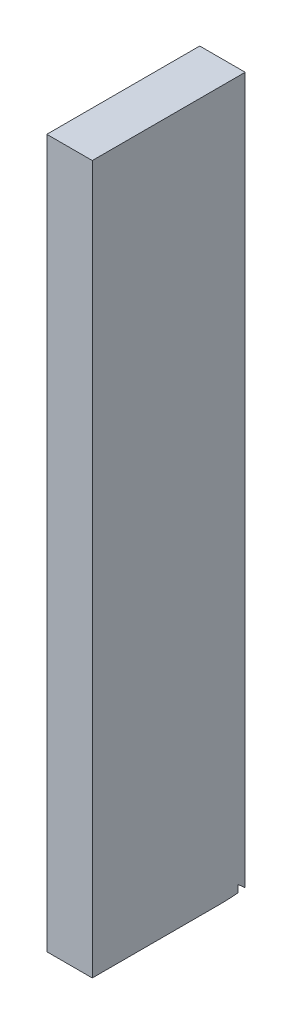
ISO-10303-21;
HEADER;
FILE_DESCRIPTION(('STEP AP214'),'2;1');
FILE_NAME('part.step','',(''),(''),'','','');
FILE_SCHEMA(('AUTOMOTIVE_DESIGN { 1 0 10303 214 1 1 1 1 }'));
ENDSEC;
DATA;
#1=APPLICATION_CONTEXT('core data for automotive mechanical design processes');
#2=APPLICATION_PROTOCOL_DEFINITION('international standard','automotive_design',2000,#1);
#3=PRODUCT_CONTEXT('',#1,'mechanical');
#4=PRODUCT('Part','Part','',(#3));
#5=PRODUCT_RELATED_PRODUCT_CATEGORY('part','',(#4));
#6=PRODUCT_DEFINITION_FORMATION('','',#4);
#7=PRODUCT_DEFINITION_CONTEXT('part definition',#1,'design');
#8=PRODUCT_DEFINITION('design','',#6,#7);
#9=PRODUCT_DEFINITION_SHAPE('','',#8);
#10=(LENGTH_UNIT() NAMED_UNIT(*) SI_UNIT(.MILLI.,.METRE.));
#11=(NAMED_UNIT(*) PLANE_ANGLE_UNIT() SI_UNIT($,.RADIAN.));
#12=(NAMED_UNIT(*) SI_UNIT($,.STERADIAN.) SOLID_ANGLE_UNIT());
#13=UNCERTAINTY_MEASURE_WITH_UNIT(LENGTH_MEASURE(1.E-05),#10,'distance_accuracy_value','');
#14=(GEOMETRIC_REPRESENTATION_CONTEXT(3) GLOBAL_UNCERTAINTY_ASSIGNED_CONTEXT((#13)) GLOBAL_UNIT_ASSIGNED_CONTEXT((#10,
#11,#12)) REPRESENTATION_CONTEXT('',''));
#15=CARTESIAN_POINT('',(0.,0.,0.));
#16=DIRECTION('',(0.,0.,1.));
#17=DIRECTION('',(1.,0.,0.));
#18=AXIS2_PLACEMENT_3D('',#15,#16,#17);
#19=CARTESIAN_POINT('',(130.275545277051,17.2651002409467,47.9190576174726));
#20=DIRECTION('',(1.69244514382854E-09,0.,-1.));
#21=DIRECTION('',(-1.,0.,-1.69244514382854E-09));
#22=AXIS2_PLACEMENT_3D('',#19,#20,#21);
#23=PLANE('',#22);
#24=CARTESIAN_POINT('',(131.258630374064,7.13214480310853,47.9190576191364));
#25=DIRECTION('',(0.,1.,0.));
#26=VECTOR('',#25,1.);
#27=LINE('',#24,#26);
#28=CARTESIAN_POINT('',(131.258630374064,7.13214480310853,47.9190576191364));
#29=VERTEX_POINT('',#28);
#30=CARTESIAN_POINT('',(131.258630374064,7.28593308702725,47.9190576191364));
#31=VERTEX_POINT('',#30);
#32=EDGE_CURVE('E119',#29,#31,#27,.T.);
#33=ORIENTED_EDGE('',*,*,#32,.F.);
#34=CARTESIAN_POINT('',(130.275545277051,7.13214480310853,47.9190576174726));
#35=DIRECTION('',(1.,0.,1.69244241849266E-09));
#36=VECTOR('',#35,1.);
#37=LINE('',#34,#36);
#38=CARTESIAN_POINT('',(130.275545277051,7.13214480310853,47.9190576174726));
#39=VERTEX_POINT('',#38);
#40=EDGE_CURVE('E35',#39,#29,#37,.T.);
#41=ORIENTED_EDGE('',*,*,#40,.F.);
#42=CARTESIAN_POINT('',(130.275545277051,7.13214480310853,47.9190576174726));
#43=DIRECTION('',(0.,1.,0.));
#44=VECTOR('',#43,1.);
#45=LINE('',#42,#44);
#46=CARTESIAN_POINT('',(130.275545277051,7.28593308702725,47.9190576174726));
#47=VERTEX_POINT('',#46);
#48=EDGE_CURVE('E237',#39,#47,#45,.T.);
#49=ORIENTED_EDGE('',*,*,#48,.T.);
#50=CARTESIAN_POINT('',(130.275545277051,7.28593308702725,47.9190576174726));
#51=DIRECTION('',(1.,0.,1.69244241849266E-09));
#52=VECTOR('',#51,1.);
#53=LINE('',#50,#52);
#54=EDGE_CURVE('E10',#47,#31,#53,.T.);
#55=ORIENTED_EDGE('',*,*,#54,.T.);
#56=EDGE_LOOP('',(#33,#41,#49,#55));
#57=FACE_BOUND('',#56,.T.);
#58=ADVANCED_FACE('F16',(#57),#23,.T.);
#59=CARTESIAN_POINT('',(130.275545277051,7.28593308702725,47.9190576174726));
#60=DIRECTION('',(-1.13344270641782E-09,-0.742625248657873,0.669707204721461));
#61=DIRECTION('',(0.,-0.669707204721461,-0.742625248657873));
#62=AXIS2_PLACEMENT_3D('',#59,#60,#61);
#63=PLANE('',#62);
#64=DIRECTION('',(1.25689951309274E-09,-0.669707204721461,-0.742625248657873));
#65=VECTOR('',#64,1.);
#66=CARTESIAN_POINT('',(131.258630374064,7.28593308702725,47.9190576191364));
#67=LINE('',#66,#65);
#68=CARTESIAN_POINT('',(131.258630374323,7.14798261558395,47.7660870337286));
#69=VERTEX_POINT('',#68);
#70=EDGE_CURVE('E144',#31,#69,#67,.T.);
#71=ORIENTED_EDGE('',*,*,#70,.F.);
#72=ORIENTED_EDGE('',*,*,#54,.F.);
#73=DIRECTION('',(1.25689951309274E-09,-0.669707204721461,-0.742625248657873));
#74=VECTOR('',#73,1.);
#75=CARTESIAN_POINT('',(130.275545277051,7.28593308702725,47.9190576174726));
#76=LINE('',#75,#74);
#77=CARTESIAN_POINT('',(130.27554527731,7.14798261558395,47.7660870320648));
#78=VERTEX_POINT('',#77);
#79=EDGE_CURVE('E315',#47,#78,#76,.T.);
#80=ORIENTED_EDGE('',*,*,#79,.T.);
#81=DIRECTION('',(1.,0.,1.69244514382854E-09));
#82=VECTOR('',#81,1.);
#83=CARTESIAN_POINT('',(130.27554527731,7.14798261558395,47.7660870320648));
#84=LINE('',#83,#82);
#85=EDGE_CURVE('E27',#78,#69,#84,.T.);
#86=ORIENTED_EDGE('',*,*,#85,.T.);
#87=EDGE_LOOP('',(#71,#72,#80,#86));
#88=FACE_BOUND('',#87,.T.);
#89=ADVANCED_FACE('F213',(#88),#63,.T.);
#90=CARTESIAN_POINT('',(130.27554527731,7.14798261558395,47.7660870320648));
#91=DIRECTION('',(1.69244514382854E-09,0.,-1.));
#92=DIRECTION('',(-1.,0.,-1.69244514382854E-09));
#93=AXIS2_PLACEMENT_3D('',#90,#91,#92);
#94=PLANE('',#93);
#95=DIRECTION('',(0.,1.,0.));
#96=VECTOR('',#95,1.);
#97=CARTESIAN_POINT('',(131.258630374323,7.14798261558395,47.7660870337286));
#98=LINE('',#97,#96);
#99=CARTESIAN_POINT('',(131.258630374323,22.4180708263544,47.7660870337286));
#100=VERTEX_POINT('',#99);
#101=EDGE_CURVE('E151',#69,#100,#98,.T.);
#102=ORIENTED_EDGE('',*,*,#101,.F.);
#103=ORIENTED_EDGE('',*,*,#85,.F.);
#104=DIRECTION('',(0.,1.,0.));
#105=VECTOR('',#104,1.);
#106=CARTESIAN_POINT('',(130.27554527731,7.14798261558395,47.7660870320648));
#107=LINE('',#106,#105);
#108=CARTESIAN_POINT('',(130.27554527731,22.4180708263544,47.7660870320648));
#109=VERTEX_POINT('',#108);
#110=EDGE_CURVE('E314',#78,#109,#107,.T.);
#111=ORIENTED_EDGE('',*,*,#110,.T.);
#112=DIRECTION('',(1.,0.,1.69244514382854E-09));
#113=VECTOR('',#112,1.);
#114=CARTESIAN_POINT('',(130.27554527731,22.4180708263544,47.7660870320648));
#115=LINE('',#114,#113);
#116=EDGE_CURVE('E172',#109,#100,#115,.T.);
#117=ORIENTED_EDGE('',*,*,#116,.T.);
#118=EDGE_LOOP('',(#102,#103,#111,#117));
#119=FACE_BOUND('',#118,.T.);
#120=ADVANCED_FACE('F210',(#119),#94,.T.);
#121=CARTESIAN_POINT('',(130.27554527731,22.4180708263544,47.7660870320648));
#122=DIRECTION('',(0.,1.,0.));
#123=DIRECTION('',(-1.,0.,0.));
#124=AXIS2_PLACEMENT_3D('',#121,#122,#123);
#125=PLANE('',#124);
#126=DIRECTION('',(-1.69244514382854E-09,0.,1.));
#127=VECTOR('',#126,1.);
#128=CARTESIAN_POINT('',(131.258630374323,22.4180708263544,47.7660870337286));
#129=LINE('',#128,#127);
#130=CARTESIAN_POINT('',(131.258630368727,22.4180708263527,51.0720282045442));
#131=VERTEX_POINT('',#130);
#132=EDGE_CURVE('E156',#100,#131,#129,.T.);
#133=ORIENTED_EDGE('',*,*,#132,.F.);
#134=ORIENTED_EDGE('',*,*,#116,.F.);
#135=DIRECTION('',(-1.69244514382854E-09,0.,1.));
#136=VECTOR('',#135,1.);
#137=CARTESIAN_POINT('',(130.27554527731,22.4180708263544,47.7660870320648));
#138=LINE('',#137,#136);
#139=CARTESIAN_POINT('',(130.275545271714,22.4180708263527,51.0720282028804));
#140=VERTEX_POINT('',#139);
#141=EDGE_CURVE('E104',#109,#140,#138,.T.);
#142=ORIENTED_EDGE('',*,*,#141,.T.);
#143=DIRECTION('',(1.,0.,1.69244514382854E-09));
#144=VECTOR('',#143,1.);
#145=CARTESIAN_POINT('',(130.275545271714,22.4180708263527,51.0720282028804));
#146=LINE('',#145,#144);
#147=EDGE_CURVE('E96',#140,#131,#146,.T.);
#148=ORIENTED_EDGE('',*,*,#147,.T.);
#149=EDGE_LOOP('',(#133,#134,#142,#148));
#150=FACE_BOUND('',#149,.T.);
#151=ADVANCED_FACE('F207',(#150),#125,.T.);
#152=CARTESIAN_POINT('',(130.275545271714,22.4180708263527,51.0720282028804));
#153=DIRECTION('',(-1.69244514382854E-09,0.,1.));
#154=DIRECTION('',(1.,0.,1.69244514382854E-09));
#155=AXIS2_PLACEMENT_3D('',#152,#153,#154);
#156=PLANE('',#155);
#157=DIRECTION('',(0.,-1.,0.));
#158=VECTOR('',#157,1.);
#159=CARTESIAN_POINT('',(131.258630368727,22.4180708263527,51.0720282045442));
#160=LINE('',#159,#158);
#161=CARTESIAN_POINT('',(131.258630368727,7.11212965553896,51.0720282003148));
#162=VERTEX_POINT('',#161);
#163=EDGE_CURVE('E159',#131,#162,#160,.T.);
#164=ORIENTED_EDGE('',*,*,#163,.F.);
#165=ORIENTED_EDGE('',*,*,#147,.F.);
#166=DIRECTION('',(0.,-1.,0.));
#167=VECTOR('',#166,1.);
#168=CARTESIAN_POINT('',(130.275545271714,22.4180708263527,51.0720282028804));
#169=LINE('',#168,#167);
#170=CARTESIAN_POINT('',(130.275545271714,7.11212965553896,51.0720281986509));
#171=VERTEX_POINT('',#170);
#172=EDGE_CURVE('E99',#140,#171,#169,.T.);
#173=ORIENTED_EDGE('',*,*,#172,.T.);
#174=DIRECTION('',(1.,0.,1.69244514382854E-09));
#175=VECTOR('',#174,1.);
#176=CARTESIAN_POINT('',(130.275545271714,7.11212965553896,51.0720281986509));
#177=LINE('',#176,#175);
#178=EDGE_CURVE('E85',#171,#162,#177,.T.);
#179=ORIENTED_EDGE('',*,*,#178,.T.);
#180=EDGE_LOOP('',(#164,#165,#173,#179));
#181=FACE_BOUND('',#180,.T.);
#182=ADVANCED_FACE('F100',(#181),#156,.T.);
#183=CARTESIAN_POINT('',(130.275545271714,7.11212965553896,51.0720281986509));
#184=DIRECTION('',(0.,-1.,0.));
#185=DIRECTION('',(0.,0.,-1.));
#186=AXIS2_PLACEMENT_3D('',#183,#184,#185);
#187=PLANE('',#186);
#188=DIRECTION('',(1.69244514382854E-09,0.,-1.));
#189=VECTOR('',#188,1.);
#190=CARTESIAN_POINT('',(131.258630368727,7.11212965553896,51.0720282003148));
#191=LINE('',#190,#189);
#192=CARTESIAN_POINT('',(131.258630373381,7.11218489328926,48.3225693777197));
#193=VERTEX_POINT('',#192);
#194=EDGE_CURVE('E92',#162,#193,#191,.T.);
#195=ORIENTED_EDGE('',*,*,#194,.F.);
#196=ORIENTED_EDGE('',*,*,#178,.F.);
#197=DIRECTION('',(1.69244514382854E-09,0.,-1.));
#198=VECTOR('',#197,1.);
#199=CARTESIAN_POINT('',(130.275545271714,7.11212965553896,51.0720281986509));
#200=LINE('',#199,#198);
#201=CARTESIAN_POINT('',(130.275545276368,7.11218489328926,48.3225693760559));
#202=VERTEX_POINT('',#201);
#203=EDGE_CURVE('E89',#171,#202,#200,.T.);
#204=ORIENTED_EDGE('',*,*,#203,.T.);
#205=CARTESIAN_POINT('',(131.258630373381,7.11218489328926,48.3225693777197));
#206=DIRECTION('',(-1.,0.,-1.69244241849266E-09));
#207=VECTOR('',#206,1.);
#208=LINE('',#205,#207);
#209=EDGE_CURVE('E61',#202,#193,#208,.F.);
#210=ORIENTED_EDGE('',*,*,#209,.T.);
#211=EDGE_LOOP('',(#195,#196,#204,#210));
#212=FACE_BOUND('',#211,.T.);
#213=ADVANCED_FACE('F87',(#212),#187,.T.);
#214=CARTESIAN_POINT('',(130.275545276368,7.11218489328926,48.3225693760559));
#215=CARTESIAN_POINT('',(130.275545276419,7.11231277382032,48.2922983488603));
#216=CARTESIAN_POINT('',(130.275545276529,7.11270986608089,48.2272172077688));
#217=CARTESIAN_POINT('',(130.275545276698,7.11639704078376,48.127380452064));
#218=CARTESIAN_POINT('',(130.275545276875,7.12255188126943,48.0230950447366));
#219=CARTESIAN_POINT('',(130.275545276992,7.12894653500751,47.9537435651444));
#220=CARTESIAN_POINT('',(130.275545277051,7.13214480310853,47.9190576174726));
#221=B_SPLINE_CURVE_WITH_KNOTS('',3,(#214,#215,#216,#217,#218,#219,#220),.UNSPECIFIED.,.F.,.F.,
(4,1,1,1,4),(0.0327527533568277,0.25007613502039,0.500002540399791,0.74992767534666,1.),.UNSPECIFIED.);
#222=DIRECTION('',(1.,0.,1.69244514382854E-09));
#223=VECTOR('',#222,1.);
#224=SURFACE_OF_LINEAR_EXTRUSION('',#221,#223);
#225=CARTESIAN_POINT('',(131.258630374064,7.13214480310853,47.9190576191364));
#226=CARTESIAN_POINT('',(131.258630374005,7.12894653500751,47.9537435668082));
#227=CARTESIAN_POINT('',(131.258630373888,7.12255188126943,48.0230950464004));
#228=CARTESIAN_POINT('',(131.258630373711,7.11639704078376,48.1273804537278));
#229=CARTESIAN_POINT('',(131.258630373542,7.11270986608089,48.2272172094326));
#230=CARTESIAN_POINT('',(131.258630373432,7.11231277382032,48.2922983505241));
#231=CARTESIAN_POINT('',(131.258630373381,7.11218489328926,48.3225693777197));
#232=B_SPLINE_CURVE_WITH_KNOTS('',3,(#225,#226,#227,#228,#229,#230,#231),.UNSPECIFIED.,.F.,.F.,
(4,1,1,1,4),(0.0327527533568277,0.282825078010168,0.532750212957037,0.782676618336438,1.),.UNSPECIFIED.);
#233=EDGE_CURVE('E162',#193,#29,#232,.F.);
#234=ORIENTED_EDGE('',*,*,#233,.F.);
#235=ORIENTED_EDGE('',*,*,#209,.F.);
#236=CARTESIAN_POINT('',(130.275545276368,7.11218489328926,48.3225693760559));
#237=CARTESIAN_POINT('',(130.275545276419,7.11231277382032,48.2922983488603));
#238=CARTESIAN_POINT('',(130.275545276529,7.11270986608089,48.2272172077688));
#239=CARTESIAN_POINT('',(130.275545276698,7.11639704078376,48.127380452064));
#240=CARTESIAN_POINT('',(130.275545276875,7.12255188126943,48.0230950447366));
#241=CARTESIAN_POINT('',(130.275545276992,7.12894653500751,47.9537435651444));
#242=CARTESIAN_POINT('',(130.275545277051,7.13214480310853,47.9190576174726));
#243=B_SPLINE_CURVE_WITH_KNOTS('',3,(#236,#237,#238,#239,#240,#241,#242),.UNSPECIFIED.,.F.,.F.,
(4,1,1,1,4),(0.0327527533568277,0.25007613502039,0.500002540399791,0.74992767534666,1.),.UNSPECIFIED.);
#244=EDGE_CURVE('E108',#202,#39,#243,.T.);
#245=ORIENTED_EDGE('',*,*,#244,.T.);
#246=ORIENTED_EDGE('',*,*,#40,.T.);
#247=EDGE_LOOP('',(#234,#235,#245,#246));
#248=FACE_BOUND('',#247,.T.);
#249=ADVANCED_FACE('F136',(#248),#224,.T.);
#250=CARTESIAN_POINT('',(130.275545201028,17.2651002409467,92.8378644340291));
#251=DIRECTION('',(1.,0.,1.69244514382854E-09));
#252=DIRECTION('',(0.,1.,0.));
#253=AXIS2_PLACEMENT_3D('',#250,#251,#252);
#254=PLANE('',#253);
#255=ORIENTED_EDGE('',*,*,#48,.F.);
#256=ORIENTED_EDGE('',*,*,#244,.F.);
#257=ORIENTED_EDGE('',*,*,#203,.F.);
#258=ORIENTED_EDGE('',*,*,#172,.F.);
#259=ORIENTED_EDGE('',*,*,#141,.F.);
#260=ORIENTED_EDGE('',*,*,#110,.F.);
#261=ORIENTED_EDGE('',*,*,#79,.F.);
#262=EDGE_LOOP('',(#255,#256,#257,#258,#259,#260,#261));
#263=FACE_BOUND('',#262,.T.);
#264=ADVANCED_FACE('F107',(#263),#254,.F.);
#265=CARTESIAN_POINT('',(131.258630298041,17.2651002409467,92.8378644356929));
#266=DIRECTION('',(1.,0.,1.69244514382854E-09));
#267=DIRECTION('',(0.,1.,0.));
#268=AXIS2_PLACEMENT_3D('',#265,#266,#267);
#269=PLANE('',#268);
#270=ORIENTED_EDGE('',*,*,#32,.T.);
#271=ORIENTED_EDGE('',*,*,#70,.T.);
#272=ORIENTED_EDGE('',*,*,#101,.T.);
#273=ORIENTED_EDGE('',*,*,#132,.T.);
#274=ORIENTED_EDGE('',*,*,#163,.T.);
#275=ORIENTED_EDGE('',*,*,#194,.T.);
#276=ORIENTED_EDGE('',*,*,#233,.T.);
#277=EDGE_LOOP('',(#270,#271,#272,#273,#274,#275,#276));
#278=FACE_BOUND('',#277,.T.);
#279=ADVANCED_FACE('F125',(#278),#269,.T.);
#280=CLOSED_SHELL('',(#58,#89,#120,#151,#182,#213,#249,#264,#279));
#281=MANIFOLD_SOLID_BREP('B1',#280);
#282=ADVANCED_BREP_SHAPE_REPRESENTATION('',(#18,#281),#14);
#283=SHAPE_DEFINITION_REPRESENTATION(#9,#282);
ENDSEC;
END-ISO-10303-21;
